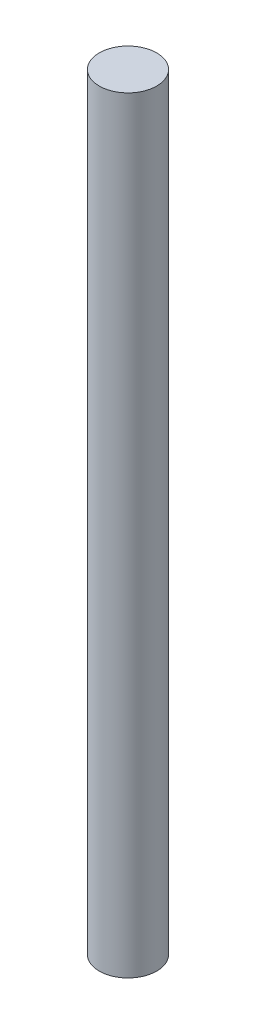
ISO-10303-21;
HEADER;
FILE_DESCRIPTION(('STEP AP214'),'2;1');
FILE_NAME('part.step','',(''),(''),'','','');
FILE_SCHEMA(('AUTOMOTIVE_DESIGN { 1 0 10303 214 1 1 1 1 }'));
ENDSEC;
DATA;
#1=APPLICATION_CONTEXT('core data for automotive mechanical design processes');
#2=APPLICATION_PROTOCOL_DEFINITION('international standard','automotive_design',2000,#1);
#3=PRODUCT_CONTEXT('',#1,'mechanical');
#4=PRODUCT('Part','Part','',(#3));
#5=PRODUCT_RELATED_PRODUCT_CATEGORY('part','',(#4));
#6=PRODUCT_DEFINITION_FORMATION('','',#4);
#7=PRODUCT_DEFINITION_CONTEXT('part definition',#1,'design');
#8=PRODUCT_DEFINITION('design','',#6,#7);
#9=PRODUCT_DEFINITION_SHAPE('','',#8);
#10=(LENGTH_UNIT() NAMED_UNIT(*) SI_UNIT(.MILLI.,.METRE.));
#11=(NAMED_UNIT(*) PLANE_ANGLE_UNIT() SI_UNIT($,.RADIAN.));
#12=(NAMED_UNIT(*) SI_UNIT($,.STERADIAN.) SOLID_ANGLE_UNIT());
#13=UNCERTAINTY_MEASURE_WITH_UNIT(LENGTH_MEASURE(1.E-05),#10,'distance_accuracy_value','');
#14=(GEOMETRIC_REPRESENTATION_CONTEXT(3) GLOBAL_UNCERTAINTY_ASSIGNED_CONTEXT((#13)) GLOBAL_UNIT_ASSIGNED_CONTEXT((#10,
#11,#12)) REPRESENTATION_CONTEXT('',''));
#15=CARTESIAN_POINT('',(0.,0.,0.));
#16=DIRECTION('',(0.,0.,1.));
#17=DIRECTION('',(1.,0.,0.));
#18=AXIS2_PLACEMENT_3D('',#15,#16,#17);
#19=CARTESIAN_POINT('',(0.,48.1076,0.));
#20=DIRECTION('',(0.,-1.,0.));
#21=DIRECTION('',(0.,0.,-1.));
#22=AXIS2_PLACEMENT_3D('',#19,#20,#21);
#23=CYLINDRICAL_SURFACE('',#22,1.8034);
#24=CARTESIAN_POINT('',(0.,48.1076,0.));
#25=DIRECTION('',(0.,1.,0.));
#26=DIRECTION('',(0.,0.,1.));
#27=AXIS2_PLACEMENT_3D('',#24,#25,#26);
#28=CIRCLE('',#27,1.8034);
#29=CARTESIAN_POINT('',(0.,48.1076,1.8034));
#30=VERTEX_POINT('',#29);
#31=EDGE_CURVE('E10',#30,#30,#28,.T.);
#32=ORIENTED_EDGE('',*,*,#31,.F.);
#33=EDGE_LOOP('',(#32));
#34=FACE_BOUND('',#33,.T.);
#35=CARTESIAN_POINT('',(0.,0.,0.));
#36=DIRECTION('',(0.,1.,0.));
#37=DIRECTION('',(0.,0.,1.));
#38=AXIS2_PLACEMENT_3D('',#35,#36,#37);
#39=CIRCLE('',#38,1.8034);
#40=CARTESIAN_POINT('',(0.,0.,1.8034));
#41=VERTEX_POINT('',#40);
#42=EDGE_CURVE('E39',#41,#41,#39,.T.);
#43=ORIENTED_EDGE('',*,*,#42,.T.);
#44=EDGE_LOOP('',(#43));
#45=FACE_BOUND('',#44,.T.);
#46=ADVANCED_FACE('F36',(#34,#45),#23,.T.);
#47=CARTESIAN_POINT('',(0.,48.1076,0.));
#48=DIRECTION('',(0.,1.,0.));
#49=DIRECTION('',(0.,0.,1.));
#50=AXIS2_PLACEMENT_3D('',#47,#48,#49);
#51=PLANE('',#50);
#52=ORIENTED_EDGE('',*,*,#31,.T.);
#53=EDGE_LOOP('',(#52));
#54=FACE_BOUND('',#53,.T.);
#55=ADVANCED_FACE('F51',(#54),#51,.T.);
#56=CARTESIAN_POINT('',(0.,0.,0.));
#57=DIRECTION('',(0.,1.,0.));
#58=DIRECTION('',(0.,0.,1.));
#59=AXIS2_PLACEMENT_3D('',#56,#57,#58);
#60=PLANE('',#59);
#61=ORIENTED_EDGE('',*,*,#42,.F.);
#62=EDGE_LOOP('',(#61));
#63=FACE_BOUND('',#62,.T.);
#64=ADVANCED_FACE('F49',(#63),#60,.F.);
#65=CLOSED_SHELL('',(#46,#55,#64));
#66=MANIFOLD_SOLID_BREP('B2',#65);
#67=ADVANCED_BREP_SHAPE_REPRESENTATION('',(#18,#66),#14);
#68=SHAPE_DEFINITION_REPRESENTATION(#9,#67);
ENDSEC;
END-ISO-10303-21;
